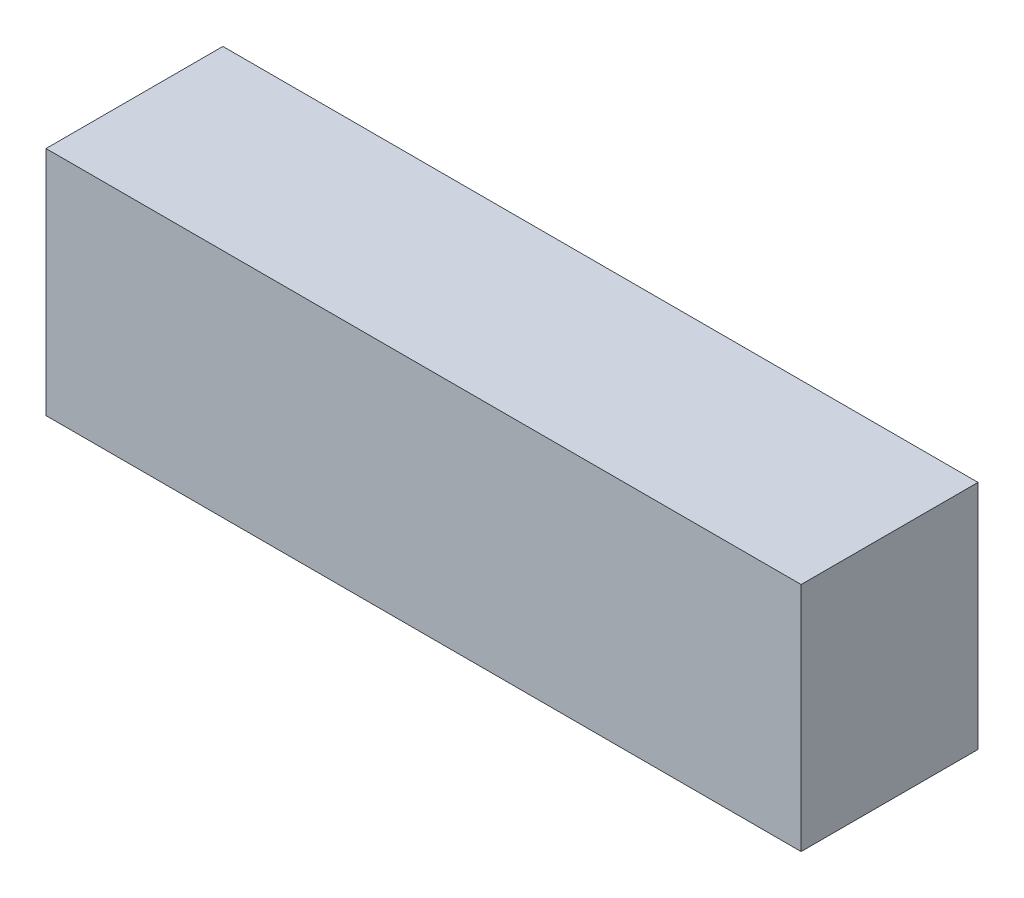
ISO-10303-21;
HEADER;
FILE_DESCRIPTION(('STEP AP214'),'2;1');
FILE_NAME('part.step','',(''),(''),'','','');
FILE_SCHEMA(('AUTOMOTIVE_DESIGN { 1 0 10303 214 1 1 1 1 }'));
ENDSEC;
DATA;
#1=APPLICATION_CONTEXT('core data for automotive mechanical design processes');
#2=APPLICATION_PROTOCOL_DEFINITION('international standard','automotive_design',2000,#1);
#3=PRODUCT_CONTEXT('',#1,'mechanical');
#4=PRODUCT('Part','Part','',(#3));
#5=PRODUCT_RELATED_PRODUCT_CATEGORY('part','',(#4));
#6=PRODUCT_DEFINITION_FORMATION('','',#4);
#7=PRODUCT_DEFINITION_CONTEXT('part definition',#1,'design');
#8=PRODUCT_DEFINITION('design','',#6,#7);
#9=PRODUCT_DEFINITION_SHAPE('','',#8);
#10=(LENGTH_UNIT() NAMED_UNIT(*) SI_UNIT(.MILLI.,.METRE.));
#11=(NAMED_UNIT(*) PLANE_ANGLE_UNIT() SI_UNIT($,.RADIAN.));
#12=(NAMED_UNIT(*) SI_UNIT($,.STERADIAN.) SOLID_ANGLE_UNIT());
#13=UNCERTAINTY_MEASURE_WITH_UNIT(LENGTH_MEASURE(1.E-05),#10,'distance_accuracy_value','');
#14=(GEOMETRIC_REPRESENTATION_CONTEXT(3) GLOBAL_UNCERTAINTY_ASSIGNED_CONTEXT((#13)) GLOBAL_UNIT_ASSIGNED_CONTEXT((#10,
#11,#12)) REPRESENTATION_CONTEXT('',''));
#15=CARTESIAN_POINT('',(0.,0.,0.));
#16=DIRECTION('',(0.,0.,1.));
#17=DIRECTION('',(1.,0.,0.));
#18=AXIS2_PLACEMENT_3D('',#15,#16,#17);
#19=CARTESIAN_POINT('',(0.,0.,26.));
#20=DIRECTION('',(1.,0.,0.));
#21=DIRECTION('',(0.,0.,-1.));
#22=AXIS2_PLACEMENT_3D('',#19,#20,#21);
#23=PLANE('',#22);
#24=DIRECTION('',(0.,-1.,0.));
#25=VECTOR('',#24,1.);
#26=CARTESIAN_POINT('',(0.,0.,0.));
#27=LINE('',#26,#25);
#28=CARTESIAN_POINT('',(0.,34.,0.));
#29=VERTEX_POINT('',#28);
#30=CARTESIAN_POINT('',(0.,0.,0.));
#31=VERTEX_POINT('',#30);
#32=EDGE_CURVE('E95',#29,#31,#27,.T.);
#33=ORIENTED_EDGE('',*,*,#32,.T.);
#34=DIRECTION('',(0.,0.,-1.));
#35=VECTOR('',#34,1.);
#36=CARTESIAN_POINT('',(0.,0.,26.));
#37=LINE('',#36,#35);
#38=CARTESIAN_POINT('',(0.,0.,26.));
#39=VERTEX_POINT('',#38);
#40=EDGE_CURVE('E11',#39,#31,#37,.T.);
#41=ORIENTED_EDGE('',*,*,#40,.F.);
#42=DIRECTION('',(0.,-1.,0.));
#43=VECTOR('',#42,1.);
#44=CARTESIAN_POINT('',(0.,0.,26.));
#45=LINE('',#44,#43);
#46=CARTESIAN_POINT('',(0.,34.,26.));
#47=VERTEX_POINT('',#46);
#48=EDGE_CURVE('E83',#47,#39,#45,.T.);
#49=ORIENTED_EDGE('',*,*,#48,.F.);
#50=DIRECTION('',(0.,0.,-1.));
#51=VECTOR('',#50,1.);
#52=CARTESIAN_POINT('',(0.,34.,26.));
#53=LINE('',#52,#51);
#54=EDGE_CURVE('E91',#47,#29,#53,.T.);
#55=ORIENTED_EDGE('',*,*,#54,.T.);
#56=EDGE_LOOP('',(#33,#41,#49,#55));
#57=FACE_BOUND('',#56,.T.);
#58=ADVANCED_FACE('F32',(#57),#23,.F.);
#59=CARTESIAN_POINT('',(0.,0.,26.));
#60=DIRECTION('',(0.,1.,0.));
#61=DIRECTION('',(0.,0.,1.));
#62=AXIS2_PLACEMENT_3D('',#59,#60,#61);
#63=PLANE('',#62);
#64=DIRECTION('',(1.,0.,0.));
#65=VECTOR('',#64,1.);
#66=CARTESIAN_POINT('',(0.,0.,0.));
#67=LINE('',#66,#65);
#68=CARTESIAN_POINT('',(111.,0.,0.));
#69=VERTEX_POINT('',#68);
#70=EDGE_CURVE('E87',#31,#69,#67,.T.);
#71=ORIENTED_EDGE('',*,*,#70,.T.);
#72=DIRECTION('',(0.,0.,-1.));
#73=VECTOR('',#72,1.);
#74=CARTESIAN_POINT('',(111.,0.,26.));
#75=LINE('',#74,#73);
#76=CARTESIAN_POINT('',(111.,0.,26.));
#77=VERTEX_POINT('',#76);
#78=EDGE_CURVE('E40',#77,#69,#75,.T.);
#79=ORIENTED_EDGE('',*,*,#78,.F.);
#80=DIRECTION('',(1.,0.,0.));
#81=VECTOR('',#80,1.);
#82=CARTESIAN_POINT('',(0.,0.,26.));
#83=LINE('',#82,#81);
#84=EDGE_CURVE('E78',#39,#77,#83,.T.);
#85=ORIENTED_EDGE('',*,*,#84,.F.);
#86=ORIENTED_EDGE('',*,*,#40,.T.);
#87=EDGE_LOOP('',(#71,#79,#85,#86));
#88=FACE_BOUND('',#87,.T.);
#89=ADVANCED_FACE('F86',(#88),#63,.F.);
#90=CARTESIAN_POINT('',(111.,0.,26.));
#91=DIRECTION('',(-1.,0.,0.));
#92=DIRECTION('',(0.,0.,1.));
#93=AXIS2_PLACEMENT_3D('',#90,#91,#92);
#94=PLANE('',#93);
#95=DIRECTION('',(0.,1.,0.));
#96=VECTOR('',#95,1.);
#97=CARTESIAN_POINT('',(111.,0.,0.));
#98=LINE('',#97,#96);
#99=CARTESIAN_POINT('',(111.,34.,0.));
#100=VERTEX_POINT('',#99);
#101=EDGE_CURVE('E65',#69,#100,#98,.T.);
#102=ORIENTED_EDGE('',*,*,#101,.T.);
#103=DIRECTION('',(0.,0.,-1.));
#104=VECTOR('',#103,1.);
#105=CARTESIAN_POINT('',(111.,34.,26.));
#106=LINE('',#105,#104);
#107=CARTESIAN_POINT('',(111.,34.,26.));
#108=VERTEX_POINT('',#107);
#109=EDGE_CURVE('E88',#108,#100,#106,.T.);
#110=ORIENTED_EDGE('',*,*,#109,.F.);
#111=DIRECTION('',(0.,1.,0.));
#112=VECTOR('',#111,1.);
#113=CARTESIAN_POINT('',(111.,0.,26.));
#114=LINE('',#113,#112);
#115=EDGE_CURVE('E81',#77,#108,#114,.T.);
#116=ORIENTED_EDGE('',*,*,#115,.F.);
#117=ORIENTED_EDGE('',*,*,#78,.T.);
#118=EDGE_LOOP('',(#102,#110,#116,#117));
#119=FACE_BOUND('',#118,.T.);
#120=ADVANCED_FACE('F89',(#119),#94,.F.);
#121=CARTESIAN_POINT('',(0.,34.,26.));
#122=DIRECTION('',(0.,-1.,0.));
#123=DIRECTION('',(0.,0.,-1.));
#124=AXIS2_PLACEMENT_3D('',#121,#122,#123);
#125=PLANE('',#124);
#126=DIRECTION('',(-1.,0.,0.));
#127=VECTOR('',#126,1.);
#128=CARTESIAN_POINT('',(0.,34.,0.));
#129=LINE('',#128,#127);
#130=EDGE_CURVE('E71',#100,#29,#129,.T.);
#131=ORIENTED_EDGE('',*,*,#130,.T.);
#132=ORIENTED_EDGE('',*,*,#54,.F.);
#133=DIRECTION('',(-1.,0.,0.));
#134=VECTOR('',#133,1.);
#135=CARTESIAN_POINT('',(0.,34.,26.));
#136=LINE('',#135,#134);
#137=EDGE_CURVE('E48',#108,#47,#136,.T.);
#138=ORIENTED_EDGE('',*,*,#137,.F.);
#139=ORIENTED_EDGE('',*,*,#109,.T.);
#140=EDGE_LOOP('',(#131,#132,#138,#139));
#141=FACE_BOUND('',#140,.T.);
#142=ADVANCED_FACE('F102',(#141),#125,.F.);
#143=CARTESIAN_POINT('',(0.,0.,26.));
#144=DIRECTION('',(0.,0.,-1.));
#145=DIRECTION('',(-1.,0.,0.));
#146=AXIS2_PLACEMENT_3D('',#143,#144,#145);
#147=PLANE('',#146);
#148=ORIENTED_EDGE('',*,*,#48,.T.);
#149=ORIENTED_EDGE('',*,*,#84,.T.);
#150=ORIENTED_EDGE('',*,*,#115,.T.);
#151=ORIENTED_EDGE('',*,*,#137,.T.);
#152=EDGE_LOOP('',(#148,#149,#150,#151));
#153=FACE_BOUND('',#152,.T.);
#154=ADVANCED_FACE('F79',(#153),#147,.F.);
#155=CARTESIAN_POINT('',(0.,0.,0.));
#156=DIRECTION('',(0.,0.,-1.));
#157=DIRECTION('',(-1.,0.,0.));
#158=AXIS2_PLACEMENT_3D('',#155,#156,#157);
#159=PLANE('',#158);
#160=ORIENTED_EDGE('',*,*,#32,.F.);
#161=ORIENTED_EDGE('',*,*,#130,.F.);
#162=ORIENTED_EDGE('',*,*,#101,.F.);
#163=ORIENTED_EDGE('',*,*,#70,.F.);
#164=EDGE_LOOP('',(#160,#161,#162,#163));
#165=FACE_BOUND('',#164,.T.);
#166=ADVANCED_FACE('F105',(#165),#159,.T.);
#167=CLOSED_SHELL('',(#58,#89,#120,#142,#154,#166));
#168=MANIFOLD_SOLID_BREP('B2',#167);
#169=ADVANCED_BREP_SHAPE_REPRESENTATION('',(#18,#168),#14);
#170=SHAPE_DEFINITION_REPRESENTATION(#9,#169);
ENDSEC;
END-ISO-10303-21;
